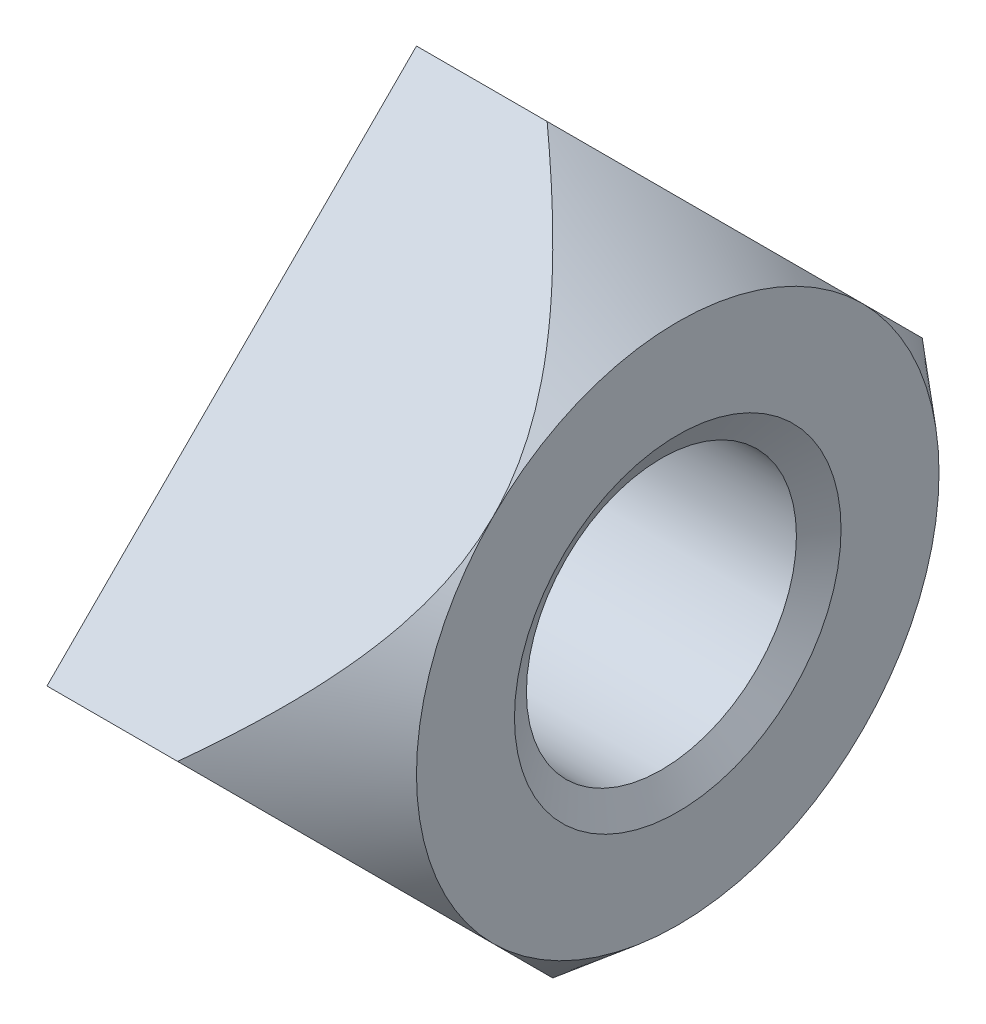
ISO-10303-21;
HEADER;
FILE_DESCRIPTION(('STEP AP214'),'2;1');
FILE_NAME('part.step','',(''),(''),'','','');
FILE_SCHEMA(('AUTOMOTIVE_DESIGN { 1 0 10303 214 1 1 1 1 }'));
ENDSEC;
DATA;
#1=APPLICATION_CONTEXT('core data for automotive mechanical design processes');
#2=APPLICATION_PROTOCOL_DEFINITION('international standard','automotive_design',2000,#1);
#3=PRODUCT_CONTEXT('',#1,'mechanical');
#4=PRODUCT('Part','Part','',(#3));
#5=PRODUCT_RELATED_PRODUCT_CATEGORY('part','',(#4));
#6=PRODUCT_DEFINITION_FORMATION('','',#4);
#7=PRODUCT_DEFINITION_CONTEXT('part definition',#1,'design');
#8=PRODUCT_DEFINITION('design','',#6,#7);
#9=PRODUCT_DEFINITION_SHAPE('','',#8);
#10=(LENGTH_UNIT() NAMED_UNIT(*) SI_UNIT(.MILLI.,.METRE.));
#11=(NAMED_UNIT(*) PLANE_ANGLE_UNIT() SI_UNIT($,.RADIAN.));
#12=(NAMED_UNIT(*) SI_UNIT($,.STERADIAN.) SOLID_ANGLE_UNIT());
#13=UNCERTAINTY_MEASURE_WITH_UNIT(LENGTH_MEASURE(1.E-05),#10,'distance_accuracy_value','');
#14=(GEOMETRIC_REPRESENTATION_CONTEXT(3) GLOBAL_UNCERTAINTY_ASSIGNED_CONTEXT((#13)) GLOBAL_UNIT_ASSIGNED_CONTEXT((#10,
#11,#12)) REPRESENTATION_CONTEXT('',''));
#15=CARTESIAN_POINT('',(0.,0.,0.));
#16=DIRECTION('',(0.,0.,1.));
#17=DIRECTION('',(1.,0.,0.));
#18=AXIS2_PLACEMENT_3D('',#15,#16,#17);
#19=CARTESIAN_POINT('',(0.,5.65685424949238,0.));
#20=DIRECTION('',(0.,0.707106781186548,-0.707106781186548));
#21=DIRECTION('',(0.,0.707106781186548,0.707106781186548));
#22=AXIS2_PLACEMENT_3D('',#19,#20,#21);
#23=PLANE('',#22);
#24=DIRECTION('',(0.,0.707106781186547,0.707106781186548));
#25=VECTOR('',#24,1.);
#26=CARTESIAN_POINT('',(0.,0.,-5.65685424949238));
#27=LINE('',#26,#25);
#28=CARTESIAN_POINT('',(0.,0.,-5.65685424949238));
#29=VERTEX_POINT('',#28);
#30=CARTESIAN_POINT('',(0.,5.65685424949238,0.));
#31=VERTEX_POINT('',#30);
#32=EDGE_CURVE('E97',#29,#31,#27,.T.);
#33=ORIENTED_EDGE('',*,*,#32,.T.);
#34=DIRECTION('',(1.,0.,0.));
#35=VECTOR('',#34,1.);
#36=CARTESIAN_POINT('',(0.,5.65685424949239,0.));
#37=LINE('',#36,#35);
#38=CARTESIAN_POINT('',(2.00000001497179,5.65685423576791,-1.37244708108853E-08));
#39=VERTEX_POINT('',#38);
#40=EDGE_CURVE('E94',#39,#31,#37,.F.);
#41=ORIENTED_EDGE('',*,*,#40,.F.);
#42=CARTESIAN_POINT('',(4.00000000162505,2.82842712469805,-2.82842712469805));
#43=CARTESIAN_POINT('',(4.00000389309699,2.86553736767645,-2.79131688178045));
#44=CARTESIAN_POINT('',(3.99875261047167,2.90264181309776,-2.7542124363849));
#45=CARTESIAN_POINT('',(3.99377703553199,2.97676203370381,-2.68009221579828));
#46=CARTESIAN_POINT('',(3.99005313230525,3.0137778219199,-2.64307642757586));
#47=CARTESIAN_POINT('',(3.97525017886926,3.12442749037937,-2.53242675910625));
#48=CARTESIAN_POINT('',(3.96053954264875,3.1978317227797,-2.45902252671088));
#49=CARTESIAN_POINT('',(3.92247950556887,3.34218649064603,-2.31466775884812));
#50=CARTESIAN_POINT('',(3.89928193162556,3.41315752138932,-2.24369672810354));
#51=CARTESIAN_POINT('',(3.84518223453002,3.5536392761493,-2.1032149733426));
#52=CARTESIAN_POINT('',(3.81427590437951,3.623149180233,-2.03370506925922));
#53=CARTESIAN_POINT('',(3.72495061105056,3.80237685552954,-1.85447739396309));
#54=CARTESIAN_POINT('',(3.66124458545734,3.91077693607113,-1.74607731342131));
#55=CARTESIAN_POINT('',(3.52074647981355,4.12323916000636,-1.53361508948595));
#56=CARTESIAN_POINT('',(3.44394435272208,4.22729789595227,-1.42955635354009));
#57=CARTESIAN_POINT('',(3.27960607328948,4.43266476485872,-1.22418948463367));
#58=CARTESIAN_POINT('',(3.19195419496411,4.53392609244055,-1.12292815705184));
#59=CARTESIAN_POINT('',(3.00918630242558,4.73293866254087,-0.923915586951505));
#60=CARTESIAN_POINT('',(2.91407263205681,4.83069099332918,-0.826163256163193));
#61=CARTESIAN_POINT('',(2.68698627585763,5.05394950334304,-0.60290474614934));
#62=CARTESIAN_POINT('',(2.55291784581515,5.17838589405658,-0.478468355435798));
#63=CARTESIAN_POINT('',(2.34766871826669,5.361061835931,-0.295792413561378));
#64=CARTESIAN_POINT('',(2.27914083218619,5.42081556040464,-0.236038689087738));
#65=CARTESIAN_POINT('',(2.14061770493488,5.53945641538055,-0.117397834111826));
#66=CARTESIAN_POINT('',(2.07062262159426,5.59834363794652,-0.0585106115458622));
#67=CARTESIAN_POINT('',(2.00000003219478,5.65685422149992,-2.79924604427178E-08));
#68=B_SPLINE_CURVE_WITH_KNOTS('',3,(#42,#43,#44,#45,#46,#47,#48,#49,#50,#51,#52,#53,#54,#55,#56,
#57,#58,#59,#60,#61,#62,#63,#64,#65,#66,#67),.UNSPECIFIED.,.F.,.F.,(4,2,2,2,2,2,2,2,2,2,2,2,4),
(0.,0.157414777931186,0.314804791192397,0.628874706757008,0.937580812012083,1.24645576144789,
1.74360479563762,2.24113696186897,2.74452653810761,3.24775862151673,3.91117052554188,
4.23755521156507,4.56390496591843),.UNSPECIFIED.);
#69=CARTESIAN_POINT('',(4.0000000011754,2.82842712502396,-2.82842712502396));
#70=VERTEX_POINT('',#69);
#71=EDGE_CURVE('E168',#70,#39,#68,.T.);
#72=ORIENTED_EDGE('',*,*,#71,.F.);
#73=CARTESIAN_POINT('',(2.00000004059492,3.38564786020558E-08,-5.65685420246291));
#74=CARTESIAN_POINT('',(2.07565016458481,0.0626824784749345,-5.59417176628507));
#75=CARTESIAN_POINT('',(2.15059314112364,0.125798019298903,-5.53105622892502));
#76=CARTESIAN_POINT('',(2.29878559514314,0.253039958257224,-5.40381429250392));
#77=CARTESIAN_POINT('',(2.37203466069001,0.317166596029325,-5.33968765380407));
#78=CARTESIAN_POINT('',(2.51699023191041,0.446963369504896,-5.20989087964427));
#79=CARTESIAN_POINT('',(2.58868371081902,0.512640801541656,-5.14421344785863));
#80=CARTESIAN_POINT('',(2.72963314079584,0.645286994596161,-5.0115672549883));
#81=CARTESIAN_POINT('',(2.79888925763179,0.712255667313801,-4.94459858220373));
#82=CARTESIAN_POINT('',(2.93735336316135,0.850535383900853,-4.80631886556531));
#83=CARTESIAN_POINT('',(3.00643466828788,0.921910119740282,-4.73494412974507));
#84=CARTESIAN_POINT('',(3.14070417214279,1.06646551765415,-4.59038873184525));
#85=CARTESIAN_POINT('',(3.20589278997801,1.139645984111,-4.51720826538326));
#86=CARTESIAN_POINT('',(3.33132997367605,1.28786318782251,-4.36899106166799));
#87=CARTESIAN_POINT('',(3.39159022752654,1.36289494937506,-4.29395930011682));
#88=CARTESIAN_POINT('',(3.50619976496109,1.51516787826736,-4.14168637122551));
#89=CARTESIAN_POINT('',(3.56055116252182,1.59240824287417,-4.06444600661834));
#90=CARTESIAN_POINT('',(3.65774238171355,1.74271904797132,-3.91413520152094));
#91=CARTESIAN_POINT('',(3.70116423929371,1.81559995696322,-3.84125429252913));
#92=CARTESIAN_POINT('',(3.78064905899603,1.9633884832786,-3.69346576621381));
#93=CARTESIAN_POINT('',(3.8167098913909,2.03829668006703,-3.61855756942535));
#94=CARTESIAN_POINT('',(3.87974313630627,2.18909933479543,-3.46775491469694));
#95=CARTESIAN_POINT('',(3.90681369673541,2.26497306566978,-3.39188118382259));
#96=CARTESIAN_POINT('',(3.95115419293496,2.41811099391466,-3.23874325557772));
#97=CARTESIAN_POINT('',(3.96843181111569,2.4953740521471,-3.16148019734528));
#98=CARTESIAN_POINT('',(3.98685420878434,2.61535176505813,-3.04150248443425));
#99=CARTESIAN_POINT('',(3.99176254119429,2.65778966671952,-2.99906458277286));
#100=CARTESIAN_POINT('',(3.99834566434411,2.74295774176928,-2.91389650772309));
#101=CARTESIAN_POINT('',(4.00000766191355,2.78568840821563,-2.87116584127675));
#102=CARTESIAN_POINT('',(4.00000000164959,2.82842712474431,-2.82842712474807));
#103=B_SPLINE_CURVE_WITH_KNOTS('',3,(#73,#74,#75,#76,#77,#78,#79,#80,#81,#82,#83,#84,#85,#86,
#87,#88,#89,#90,#91,#92,#93,#94,#95,#96,#97,#98,#99,#100,#101,#102),.UNSPECIFIED.,.F.,.F.,(4,2,
2,2,2,2,2,2,2,2,2,2,2,2,4),(0.,0.349620599170228,0.699325345274281,1.05128989036734,
1.40323045151287,1.77010143677858,2.13693285133392,2.5028674218376,2.86867064024405,
3.20396363789336,3.5393535070604,3.87095130705531,4.20228861242727,4.38285917959157,
4.56413991570658),.UNSPECIFIED.);
#104=CARTESIAN_POINT('',(2.00000001498846,-1.37205579659539E-08,-5.65685423577182));
#105=VERTEX_POINT('',#104);
#106=EDGE_CURVE('E81',#105,#70,#103,.T.);
#107=ORIENTED_EDGE('',*,*,#106,.F.);
#108=DIRECTION('',(1.,0.,0.));
#109=VECTOR('',#108,1.);
#110=CARTESIAN_POINT('',(0.,0.,-5.65685424949238));
#111=LINE('',#110,#109);
#112=EDGE_CURVE('E72',#29,#105,#111,.T.);
#113=ORIENTED_EDGE('',*,*,#112,.F.);
#114=EDGE_LOOP('',(#33,#41,#72,#107,#113));
#115=FACE_BOUND('',#114,.T.);
#116=ADVANCED_FACE('F15',(#115),#23,.T.);
#117=CARTESIAN_POINT('',(0.,0.,5.65685424949238));
#118=DIRECTION('',(0.,0.707106781186547,0.707106781186548));
#119=DIRECTION('',(0.,-0.707106781186548,0.707106781186547));
#120=AXIS2_PLACEMENT_3D('',#117,#118,#119);
#121=PLANE('',#120);
#122=DIRECTION('',(1.,0.,0.));
#123=VECTOR('',#122,1.);
#124=CARTESIAN_POINT('',(0.,0.,5.65685424949238));
#125=LINE('',#124,#123);
#126=CARTESIAN_POINT('',(2.00000001819448,1.63942346002782E-08,5.65685423309814));
#127=VERTEX_POINT('',#126);
#128=CARTESIAN_POINT('',(0.,0.,5.65685424949238));
#129=VERTEX_POINT('',#128);
#130=EDGE_CURVE('E73',#127,#129,#125,.F.);
#131=ORIENTED_EDGE('',*,*,#130,.F.);
#132=CARTESIAN_POINT('',(4.00000000162504,2.82842712469805,2.82842712469805));
#133=CARTESIAN_POINT('',(4.00000389309698,2.79131688178079,2.86553736767611));
#134=CARTESIAN_POINT('',(3.99875261047169,2.75421243638558,2.90264181309709));
#135=CARTESIAN_POINT('',(3.9937770355321,2.68009221579965,2.97676203370245));
#136=CARTESIAN_POINT('',(3.99005313230543,2.64307642757756,3.01377782191821));
#137=CARTESIAN_POINT('',(3.97525017886971,2.53242675910895,3.12442749037668));
#138=CARTESIAN_POINT('',(3.96053954264946,2.45902252671424,3.19783172277635));
#139=CARTESIAN_POINT('',(3.9224795055699,2.31466775885142,3.34218649064273));
#140=CARTESIAN_POINT('',(3.89928193162649,2.24369672810617,3.4131575213867));
#141=CARTESIAN_POINT('',(3.84518223453059,2.10321497334389,3.55363927614801));
#142=CARTESIAN_POINT('',(3.81427590437982,2.03370506925986,3.62314918023237));
#143=CARTESIAN_POINT('',(3.72495061104942,1.85447739396083,3.80237685553181));
#144=CARTESIAN_POINT('',(3.66124458545473,1.74607731341688,3.91077693607558));
#145=CARTESIAN_POINT('',(3.5207464798075,1.53361508947732,4.123239160015));
#146=CARTESIAN_POINT('',(3.44394435271409,1.42955635352943,4.22729789596293));
#147=CARTESIAN_POINT('',(3.27960607328064,1.22418948462333,4.43266476486907));
#148=CARTESIAN_POINT('',(3.19195419495677,1.12292815704366,4.53392609244873));
#149=CARTESIAN_POINT('',(3.00918630242169,0.923915586947467,4.73293866254491));
#150=CARTESIAN_POINT('',(2.91407263205489,0.826163256161125,4.83069099333126));
#151=CARTESIAN_POINT('',(2.68698627681076,0.602904747086648,5.05394950240574));
#152=CARTESIAN_POINT('',(2.55291784779398,0.47846835727349,5.17838589221889));
#153=CARTESIAN_POINT('',(2.34766872183072,0.295792416696062,5.36106183279632));
#154=CARTESIAN_POINT('',(2.27914083627727,0.236038692638824,5.42081555685356));
#155=CARTESIAN_POINT('',(2.14061771009615,0.117397838485161,5.53945641100722));
#156=CARTESIAN_POINT('',(2.07062262729868,0.058510616325048,5.59834363316733));
#157=CARTESIAN_POINT('',(2.0000000384487,3.31733880936239E-08,5.65685421631899));
#158=B_SPLINE_CURVE_WITH_KNOTS('',3,(#132,#133,#134,#135,#136,#137,#138,#139,#140,#141,#142,
#143,#144,#145,#146,#147,#148,#149,#150,#151,#152,#153,#154,#155,#156,#157),.UNSPECIFIED.,.F.,
.F.,(4,2,2,2,2,2,2,2,2,2,2,2,4),(0.,0.157414777929742,0.314804791189509,0.628874706751271,
0.937580812009219,1.24645576144789,1.7436047956478,2.24113696188942,2.74452653811793,
3.24775862151673,3.91117052064458,4.2375552042998,4.56390495628676),.UNSPECIFIED.);
#159=CARTESIAN_POINT('',(4.0000000011754,2.82842712502396,2.82842712502396));
#160=VERTEX_POINT('',#159);
#161=EDGE_CURVE('E127',#160,#127,#158,.T.);
#162=ORIENTED_EDGE('',*,*,#161,.F.);
#163=CARTESIAN_POINT('',(2.00000004058299,5.65685420245787,3.38645890575871E-08));
#164=CARTESIAN_POINT('',(2.07565016457221,5.59417176627938,0.0626824784817339));
#165=CARTESIAN_POINT('',(2.15059314111072,5.53105622891946,0.125798019304764));
#166=CARTESIAN_POINT('',(2.2987855951299,5.40381429249932,0.253039958261537));
#167=CARTESIAN_POINT('',(2.37203466067678,5.3396876538003,0.317166596033027));
#168=CARTESIAN_POINT('',(2.51699023189712,5.20989087964198,0.446963369507273));
#169=CARTESIAN_POINT('',(2.58868371080568,5.144213447857,0.512640801543317));
#170=CARTESIAN_POINT('',(2.72963314078247,5.01156725498805,0.645286994596402));
#171=CARTESIAN_POINT('',(2.79888925761844,4.94459858220419,0.71225566731334));
#172=CARTESIAN_POINT('',(2.9373533631481,4.80631886556722,0.850535383898957));
#173=CARTESIAN_POINT('',(3.00643466827471,4.73494412974771,0.921910119737654));
#174=CARTESIAN_POINT('',(3.14070417212986,4.59038873184936,1.06646551765005));
#175=CARTESIAN_POINT('',(3.20589278996524,4.51720826538811,1.13964598410615));
#176=CARTESIAN_POINT('',(3.33132997366368,4.36899106167434,1.28786318781617));
#177=CARTESIAN_POINT('',(3.39159022751442,4.29395930012392,1.36289494936796));
#178=CARTESIAN_POINT('',(3.50619976494959,4.14168637123413,1.51516787825876));
#179=CARTESIAN_POINT('',(3.56055116251068,4.06444600662771,1.5924082428648));
#180=CARTESIAN_POINT('',(3.65774238170326,3.91413520153173,1.74271904796054));
#181=CARTESIAN_POINT('',(3.7011642392839,3.84125429254057,1.81559995695179));
#182=CARTESIAN_POINT('',(3.78064905898729,3.69346576622654,1.96338848326588));
#183=CARTESIAN_POINT('',(3.81670989138276,3.61855756943873,2.03829668005367));
#184=CARTESIAN_POINT('',(3.87974313629944,3.46775491471157,2.18909933478081));
#185=CARTESIAN_POINT('',(3.90681369672929,3.39188118383784,2.26497306565454));
#186=CARTESIAN_POINT('',(3.95115419293037,3.23874325559417,2.41811099389822));
#187=CARTESIAN_POINT('',(3.96843181111192,3.16148019736229,2.49537405213009));
#188=CARTESIAN_POINT('',(3.98685420878238,3.04150248444893,2.61535176504346));
#189=CARTESIAN_POINT('',(3.99176254119306,2.99906458278464,2.65778966670774));
#190=CARTESIAN_POINT('',(3.99834566434386,2.91389650772902,2.74295774176337));
#191=CARTESIAN_POINT('',(4.00000766191355,2.87116584127972,2.78568840821267));
#192=CARTESIAN_POINT('',(4.00000000164958,2.82842712474808,2.82842712474431));
#193=B_SPLINE_CURVE_WITH_KNOTS('',3,(#163,#164,#165,#166,#167,#168,#169,#170,#171,#172,#173,
#174,#175,#176,#177,#178,#179,#180,#181,#182,#183,#184,#185,#186,#187,#188,#189,#190,#191,#192),
.UNSPECIFIED.,.F.,.F.,(4,2,2,2,2,2,2,2,2,2,2,2,2,2,4),(0.,0.349620599167865,0.699325345269563,
1.05128989036022,1.40323045150335,1.77010143676664,2.13693285131956,2.50286742182085,
2.86867064022491,3.20396363787222,3.53935350703727,3.87095130703016,4.20228861240011,
4.38285917957684,4.5641399157044),.UNSPECIFIED.);
#194=EDGE_CURVE('E39',#39,#160,#193,.T.);
#195=ORIENTED_EDGE('',*,*,#194,.F.);
#196=ORIENTED_EDGE('',*,*,#40,.T.);
#197=DIRECTION('',(0.,-0.707106781186548,0.707106781186547));
#198=VECTOR('',#197,1.);
#199=CARTESIAN_POINT('',(0.,5.65685424949238,0.));
#200=LINE('',#199,#198);
#201=EDGE_CURVE('E100',#31,#129,#200,.T.);
#202=ORIENTED_EDGE('',*,*,#201,.T.);
#203=EDGE_LOOP('',(#131,#162,#195,#196,#202));
#204=FACE_BOUND('',#203,.T.);
#205=ADVANCED_FACE('F138',(#204),#121,.T.);
#206=CARTESIAN_POINT('',(0.,-5.65685424949238,0.));
#207=DIRECTION('',(0.,-0.707106781186548,0.707106781186547));
#208=DIRECTION('',(0.,-0.707106781186547,-0.707106781186548));
#209=AXIS2_PLACEMENT_3D('',#206,#207,#208);
#210=PLANE('',#209);
#211=DIRECTION('',(1.,0.,0.));
#212=VECTOR('',#211,1.);
#213=CARTESIAN_POINT('',(0.,-5.65685424949238,0.));
#214=LINE('',#213,#212);
#215=CARTESIAN_POINT('',(2.00000001497181,-5.65685423576789,1.37244880754627E-08));
#216=VERTEX_POINT('',#215);
#217=CARTESIAN_POINT('',(0.,-5.65685424949238,0.));
#218=VERTEX_POINT('',#217);
#219=EDGE_CURVE('E59',#216,#218,#214,.F.);
#220=ORIENTED_EDGE('',*,*,#219,.F.);
#221=CARTESIAN_POINT('',(4.00000000162504,-2.82842712469805,2.82842712469805));
#222=CARTESIAN_POINT('',(4.00000389309698,-2.86553736767646,2.79131688178045));
#223=CARTESIAN_POINT('',(3.99875261047167,-2.90264181309777,2.7542124363849));
#224=CARTESIAN_POINT('',(3.99377703553198,-2.97676203370381,2.68009221579829));
#225=CARTESIAN_POINT('',(3.99005313230525,-3.01377782191991,2.64307642757586));
#226=CARTESIAN_POINT('',(3.97525017886926,-3.12442749037938,2.53242675910625));
#227=CARTESIAN_POINT('',(3.96053954264875,-3.1978317227797,2.45902252671088));
#228=CARTESIAN_POINT('',(3.92247950556886,-3.34218649064603,2.31466775884812));
#229=CARTESIAN_POINT('',(3.89928193162556,-3.41315752138932,2.24369672810354));
#230=CARTESIAN_POINT('',(3.84518223453001,-3.5536392761493,2.1032149733426));
#231=CARTESIAN_POINT('',(3.8142759043795,-3.62314918023301,2.03370506925922));
#232=CARTESIAN_POINT('',(3.72495061105055,-3.80237685552955,1.85447739396309));
#233=CARTESIAN_POINT('',(3.66124458545734,-3.91077693607114,1.74607731342131));
#234=CARTESIAN_POINT('',(3.52074647981354,-4.12323916000636,1.53361508948595));
#235=CARTESIAN_POINT('',(3.44394435272207,-4.22729789595228,1.42955635354009));
#236=CARTESIAN_POINT('',(3.27960607328948,-4.43266476485873,1.22418948463367));
#237=CARTESIAN_POINT('',(3.19195419496411,-4.53392609244055,1.12292815705183));
#238=CARTESIAN_POINT('',(3.00918630242557,-4.73293866254087,0.923915586951504));
#239=CARTESIAN_POINT('',(2.9140726320568,-4.83069099332919,0.826163256163192));
#240=CARTESIAN_POINT('',(2.68698627585764,-5.05394950334304,0.602904746149346));
#241=CARTESIAN_POINT('',(2.55291784581516,-5.17838589405657,0.478468355435809));
#242=CARTESIAN_POINT('',(2.3476687182667,-5.36106183593098,0.295792413561397));
#243=CARTESIAN_POINT('',(2.27914083218622,-5.42081556040462,0.23603868908776));
#244=CARTESIAN_POINT('',(2.14061770493491,-5.53945641538053,0.117397834111853));
#245=CARTESIAN_POINT('',(2.07062262159429,-5.59834363794649,0.0585106115458926));
#246=CARTESIAN_POINT('',(2.00000003219481,-5.65685422149989,2.79924934257765E-08));
#247=B_SPLINE_CURVE_WITH_KNOTS('',3,(#221,#222,#223,#224,#225,#226,#227,#228,#229,#230,#231,
#232,#233,#234,#235,#236,#237,#238,#239,#240,#241,#242,#243,#244,#245,#246),.UNSPECIFIED.,.F.,
.F.,(4,2,2,2,2,2,2,2,2,2,2,2,4),(0.,0.157414777931187,0.314804791192397,0.628874706757008,
0.937580812012084,1.24645576144789,1.74360479563762,2.24113696186897,2.74452653810761,
3.24775862151674,3.91117052554185,4.23755521156502,4.56390496591836),.UNSPECIFIED.);
#248=CARTESIAN_POINT('',(4.0000000011754,-2.82842712502396,2.82842712502396));
#249=VERTEX_POINT('',#248);
#250=EDGE_CURVE('E63',#249,#216,#247,.T.);
#251=ORIENTED_EDGE('',*,*,#250,.F.);
#252=CARTESIAN_POINT('',(2.00000003144196,-2.55372012351044E-08,5.6568542015556));
#253=CARTESIAN_POINT('',(2.07565015742389,-0.062682472229833,5.59417176921554));
#254=CARTESIAN_POINT('',(2.15059313492845,-0.125798013994227,5.53105623334125));
#255=CARTESIAN_POINT('',(2.29878558996535,-0.253039953828893,5.40381429782092));
#256=CARTESIAN_POINT('',(2.37203465556383,-0.317166591536578,5.33968765853567));
#257=CARTESIAN_POINT('',(2.51699022711945,-0.446963365146998,5.20989088376178));
#258=CARTESIAN_POINT('',(2.58868370631345,-0.51264079738465,5.14421345195115));
#259=CARTESIAN_POINT('',(2.72963313679467,-0.645286990774541,5.01156725887443));
#260=CARTESIAN_POINT('',(2.79888925384954,-0.712255663626735,4.94459858590841));
#261=CARTESIAN_POINT('',(2.93735335983418,-0.850535380508865,4.80631886893895));
#262=CARTESIAN_POINT('',(3.00643466519755,-0.921910116509753,4.73494413297069));
#263=CARTESIAN_POINT('',(3.14070416951212,-1.06646551474678,4.59038873475755));
#264=CARTESIAN_POINT('',(3.20589278757018,-1.13964598136532,4.51720826813027));
#265=CARTESIAN_POINT('',(3.33132997170457,-1.28786318541231,4.36899106407689));
#266=CARTESIAN_POINT('',(3.39159022576841,-1.36289494713871,4.29395930235283));
#267=CARTESIAN_POINT('',(3.50619976361054,-1.51516787638917,4.14168637310406));
#268=CARTESIAN_POINT('',(3.56055116136544,-1.5924082411803,4.06444600831231));
#269=CARTESIAN_POINT('',(3.65774238079886,-1.74271904648244,3.91413520300975));
#270=CARTESIAN_POINT('',(3.70116423844238,-1.81559995548962,3.84125429400271));
#271=CARTESIAN_POINT('',(3.78064905827333,-1.96338848183594,3.69346576765649));
#272=CARTESIAN_POINT('',(3.81670989073362,-2.03829667863999,3.61855757085241));
#273=CARTESIAN_POINT('',(3.8797431357813,-2.1890993334035,3.46775491608887));
#274=CARTESIAN_POINT('',(3.90681369627719,-2.26497306429735,3.39188118519503));
#275=CARTESIAN_POINT('',(3.95115419260936,-2.41811099258582,3.23874325690657));
#276=CARTESIAN_POINT('',(3.9684318108559,-2.49537405084238,3.16148019865));
#277=CARTESIAN_POINT('',(3.98685420865243,-2.61535176398984,3.04150248550255));
#278=CARTESIAN_POINT('',(3.9917625411115,-2.65778966586294,2.99906458362944));
#279=CARTESIAN_POINT('',(3.99834566432746,-2.74295774133935,2.91389650815304));
#280=CARTESIAN_POINT('',(4.00000766191374,-2.78568840800062,2.87116584149176));
#281=CARTESIAN_POINT('',(4.00000000164958,-2.82842712474431,2.82842712474807));
#282=B_SPLINE_CURVE_WITH_KNOTS('',3,(#252,#253,#254,#255,#256,#257,#258,#259,#260,#261,#262,
#263,#264,#265,#266,#267,#268,#269,#270,#271,#272,#273,#274,#275,#276,#277,#278,#279,#280,#281),
.UNSPECIFIED.,.F.,.F.,(4,2,2,2,2,2,2,2,2,2,2,2,2,2,4),(0.,0.349620600145803,0.699325347193026,
1.05128989319673,1.40323045526734,1.77010144147746,2.13693285697511,2.50286742843413,
2.86867064779937,3.20396364558243,3.53935351487567,3.87095131499979,4.20228862050367,
4.38285918857396,4.56413992560064),.UNSPECIFIED.);
#283=EDGE_CURVE('E101',#127,#249,#282,.T.);
#284=ORIENTED_EDGE('',*,*,#283,.F.);
#285=ORIENTED_EDGE('',*,*,#130,.T.);
#286=DIRECTION('',(0.,-0.707106781186547,-0.707106781186548));
#287=VECTOR('',#286,1.);
#288=CARTESIAN_POINT('',(0.,0.,5.65685424949238));
#289=LINE('',#288,#287);
#290=EDGE_CURVE('E67',#129,#218,#289,.T.);
#291=ORIENTED_EDGE('',*,*,#290,.T.);
#292=EDGE_LOOP('',(#220,#251,#284,#285,#291));
#293=FACE_BOUND('',#292,.T.);
#294=ADVANCED_FACE('F61',(#293),#210,.T.);
#295=CARTESIAN_POINT('',(0.,0.,-5.65685424949238));
#296=DIRECTION('',(0.,-0.707106781186547,-0.707106781186548));
#297=DIRECTION('',(0.,0.707106781186548,-0.707106781186547));
#298=AXIS2_PLACEMENT_3D('',#295,#296,#297);
#299=PLANE('',#298);
#300=DIRECTION('',(0.,0.707106781186548,-0.707106781186547));
#301=VECTOR('',#300,1.);
#302=CARTESIAN_POINT('',(0.,-5.65685424949238,0.));
#303=LINE('',#302,#301);
#304=EDGE_CURVE('E102',#218,#29,#303,.T.);
#305=ORIENTED_EDGE('',*,*,#304,.T.);
#306=ORIENTED_EDGE('',*,*,#112,.T.);
#307=CARTESIAN_POINT('',(4.00000000162504,-2.82842712469805,-2.82842712469805));
#308=CARTESIAN_POINT('',(4.00000389309698,-2.79131688178057,-2.86553736767633));
#309=CARTESIAN_POINT('',(3.99875261047169,-2.75421243638514,-2.90264181309753));
#310=CARTESIAN_POINT('',(3.99377703553209,-2.68009221579876,-2.97676203370333));
#311=CARTESIAN_POINT('',(3.99005313230542,-2.64307642757645,-3.01377782191932));
#312=CARTESIAN_POINT('',(3.97525017886968,-2.53242675910718,-3.12442749037845));
#313=CARTESIAN_POINT('',(3.96053954264941,-2.45902252671202,-3.19783172277856));
#314=CARTESIAN_POINT('',(3.92247950557014,-2.31466775884962,-3.34218649064453));
#315=CARTESIAN_POINT('',(3.8992819316272,-2.2436967281052,-3.41315752138767));
#316=CARTESIAN_POINT('',(3.84518223453248,-2.10321497334452,-3.55363927614738));
#317=CARTESIAN_POINT('',(3.81427590438243,-2.03370506926126,-3.62314918023097));
#318=CARTESIAN_POINT('',(3.72495061105426,-1.85447739396437,-3.80237685552826));
#319=CARTESIAN_POINT('',(3.66124458546127,-1.74607731342174,-3.91077693607071));
#320=CARTESIAN_POINT('',(3.52074647981779,-1.53361508948465,-4.12323916000766));
#321=CARTESIAN_POINT('',(3.44394435272642,-1.42955635353792,-4.22729789595444));
#322=CARTESIAN_POINT('',(3.27960607329394,-1.22418948462978,-4.43266476486262));
#323=CARTESIAN_POINT('',(3.19195419496859,-1.12292815704708,-4.53392609244531));
#324=CARTESIAN_POINT('',(3.00918630243002,-0.923915586945024,-4.73293866254735));
#325=CARTESIAN_POINT('',(2.9140726320612,-0.826163256155852,-4.83069099333653));
#326=CARTESIAN_POINT('',(2.68698627586318,-0.60290474614131,-5.05394950335107));
#327=CARTESIAN_POINT('',(2.55291784582199,-0.478468355427887,-5.17838589406449));
#328=CARTESIAN_POINT('',(2.34766871827548,-0.295792413553577,-5.3610618359388));
#329=CARTESIAN_POINT('',(2.27914083219563,-0.236038689079956,-5.42081556041242));
#330=CARTESIAN_POINT('',(2.1406177049456,-0.117397834104067,-5.53945641538831));
#331=CARTESIAN_POINT('',(2.07062262160564,-0.058510611538108,-5.59834363795427));
#332=CARTESIAN_POINT('',(2.00000003220681,-2.79847045924306E-08,-5.65685422150767));
#333=B_SPLINE_CURVE_WITH_KNOTS('',3,(#307,#308,#309,#310,#311,#312,#313,#314,#315,#316,#317,
#318,#319,#320,#321,#322,#323,#324,#325,#326,#327,#328,#329,#330,#331,#332),.UNSPECIFIED.,.F.,
.F.,(4,2,2,2,2,2,2,2,2,2,2,2,4),(0.,0.15741477793068,0.314804791191386,0.628874706755014,
0.937580812009224,1.24645576144416,1.743604795637,2.24113696187146,2.74452653811319,
3.24775862152541,3.91117052554782,4.23755521156973,4.56390496592182),.UNSPECIFIED.);
#334=CARTESIAN_POINT('',(4.0000000011754,-2.82842712502396,-2.82842712502396));
#335=VERTEX_POINT('',#334);
#336=EDGE_CURVE('E85',#335,#105,#333,.T.);
#337=ORIENTED_EDGE('',*,*,#336,.F.);
#338=CARTESIAN_POINT('',(2.00000004058294,-5.65685420245787,-3.38645369290942E-08));
#339=CARTESIAN_POINT('',(2.07565016457217,-5.5941717662794,-0.0626824784816929));
#340=CARTESIAN_POINT('',(2.15059314111068,-5.53105622891949,-0.125798019304729));
#341=CARTESIAN_POINT('',(2.29878559512987,-5.40381429249935,-0.253039958261508));
#342=CARTESIAN_POINT('',(2.37203466067675,-5.33968765380032,-0.317166596032998));
#343=CARTESIAN_POINT('',(2.5169902318971,-5.209890879642,-0.446963369507244));
#344=CARTESIAN_POINT('',(2.58868371080566,-5.14421344785703,-0.512640801543289));
#345=CARTESIAN_POINT('',(2.72963314078245,-5.01156725498807,-0.645286994596377));
#346=CARTESIAN_POINT('',(2.79888925761842,-4.94459858220421,-0.712255667313316));
#347=CARTESIAN_POINT('',(2.93735336314808,-4.80631886556724,-0.850535383898934));
#348=CARTESIAN_POINT('',(3.00643466827469,-4.73494412974773,-0.921910119737632));
#349=CARTESIAN_POINT('',(3.14070417212985,-4.59038873184938,-1.06646551765003));
#350=CARTESIAN_POINT('',(3.20589278996523,-4.51720826538813,-1.13964598410614));
#351=CARTESIAN_POINT('',(3.33132997366367,-4.36899106167436,-1.28786318781615));
#352=CARTESIAN_POINT('',(3.39159022751441,-4.29395930012393,-1.36289494936795));
#353=CARTESIAN_POINT('',(3.50619976494958,-4.14168637123414,-1.51516787825875));
#354=CARTESIAN_POINT('',(3.56055116251067,-4.06444600662772,-1.59240824286479));
#355=CARTESIAN_POINT('',(3.65774238170326,-3.91413520153174,-1.74271904796053));
#356=CARTESIAN_POINT('',(3.70116423928389,-3.84125429254057,-1.81559995695178));
#357=CARTESIAN_POINT('',(3.78064905898729,-3.69346576622655,-1.96338848326587));
#358=CARTESIAN_POINT('',(3.81670989138276,-3.61855756943873,-2.03829668005366));
#359=CARTESIAN_POINT('',(3.87974313629944,-3.46775491471158,-2.1890993347808));
#360=CARTESIAN_POINT('',(3.90681369672929,-3.39188118383785,-2.26497306565453));
#361=CARTESIAN_POINT('',(3.95115419293037,-3.23874325559417,-2.41811099389821));
#362=CARTESIAN_POINT('',(3.96843181111192,-3.1614801973623,-2.49537405213009));
#363=CARTESIAN_POINT('',(3.98685420878238,-3.04150248444893,-2.61535176504345));
#364=CARTESIAN_POINT('',(3.99176254119306,-2.99906458278465,-2.65778966670774));
#365=CARTESIAN_POINT('',(3.99834566434386,-2.91389650772902,-2.74295774176337));
#366=CARTESIAN_POINT('',(4.00000766191355,-2.87116584127972,-2.78568840821267));
#367=CARTESIAN_POINT('',(4.00000000164958,-2.82842712474807,-2.82842712474431));
#368=B_SPLINE_CURVE_WITH_KNOTS('',3,(#338,#339,#340,#341,#342,#343,#344,#345,#346,#347,#348,
#349,#350,#351,#352,#353,#354,#355,#356,#357,#358,#359,#360,#361,#362,#363,#364,#365,#366,#367),
.UNSPECIFIED.,.F.,.F.,(4,2,2,2,2,2,2,2,2,2,2,2,2,2,4),(0.,0.34962059916787,0.699325345269574,
1.05128989036024,1.40323045150337,1.77010143676667,2.1369328513196,2.5028674218209,
2.86867064022495,3.20396363787227,3.53935350703731,3.87095130703021,4.20228861240016,
4.38285917957689,4.56413991570446),.UNSPECIFIED.);
#369=EDGE_CURVE('E19',#216,#335,#368,.T.);
#370=ORIENTED_EDGE('',*,*,#369,.F.);
#371=ORIENTED_EDGE('',*,*,#219,.T.);
#372=EDGE_LOOP('',(#305,#306,#337,#370,#371));
#373=FACE_BOUND('',#372,.T.);
#374=ADVANCED_FACE('F83',(#373),#299,.T.);
#375=CARTESIAN_POINT('',(1.98800008109856,0.,0.));
#376=DIRECTION('',(-1.,0.,0.));
#377=DIRECTION('',(0.,0.,1.));
#378=AXIS2_PLACEMENT_3D('',#375,#376,#377);
#379=CONICAL_SURFACE('',#378,5.66679530646752,0.691835812846211);
#380=CARTESIAN_POINT('',(4.00000000070122,0.,0.));
#381=DIRECTION('',(-1.,0.,0.));
#382=DIRECTION('',(0.,0.,1.));
#383=AXIS2_PLACEMENT_3D('',#380,#381,#382);
#384=CIRCLE('',#383,4.00000000078565);
#385=EDGE_CURVE('E80',#249,#335,#384,.F.);
#386=ORIENTED_EDGE('',*,*,#385,.F.);
#387=ORIENTED_EDGE('',*,*,#250,.T.);
#388=ORIENTED_EDGE('',*,*,#369,.T.);
#389=EDGE_LOOP('',(#386,#387,#388));
#390=FACE_BOUND('',#389,.T.);
#391=ADVANCED_FACE('F78',(#390),#379,.T.);
#392=CARTESIAN_POINT('',(1.98800008132594,0.,0.));
#393=DIRECTION('',(-1.,0.,0.));
#394=DIRECTION('',(0.,0.,1.));
#395=AXIS2_PLACEMENT_3D('',#392,#393,#394);
#396=CONICAL_SURFACE('',#395,5.66679530629699,0.691835812851467);
#397=CARTESIAN_POINT('',(4.00000000070122,0.,0.));
#398=DIRECTION('',(-1.,0.,0.));
#399=DIRECTION('',(0.,0.,1.));
#400=AXIS2_PLACEMENT_3D('',#397,#398,#399);
#401=CIRCLE('',#400,4.00000000078565);
#402=EDGE_CURVE('E117',#335,#70,#401,.F.);
#403=ORIENTED_EDGE('',*,*,#402,.F.);
#404=ORIENTED_EDGE('',*,*,#336,.T.);
#405=ORIENTED_EDGE('',*,*,#106,.T.);
#406=EDGE_LOOP('',(#403,#404,#405));
#407=FACE_BOUND('',#406,.T.);
#408=ADVANCED_FACE('F153',(#407),#396,.T.);
#409=CARTESIAN_POINT('',(1.98800008109856,0.,0.));
#410=DIRECTION('',(-1.,0.,0.));
#411=DIRECTION('',(0.,0.,1.));
#412=AXIS2_PLACEMENT_3D('',#409,#410,#411);
#413=CONICAL_SURFACE('',#412,5.66679530646752,0.691835812846211);
#414=CARTESIAN_POINT('',(4.00000000070122,0.,0.));
#415=DIRECTION('',(-1.,0.,0.));
#416=DIRECTION('',(0.,0.,1.));
#417=AXIS2_PLACEMENT_3D('',#414,#415,#416);
#418=CIRCLE('',#417,4.00000000078565);
#419=EDGE_CURVE('E115',#70,#160,#418,.F.);
#420=ORIENTED_EDGE('',*,*,#419,.F.);
#421=ORIENTED_EDGE('',*,*,#71,.T.);
#422=ORIENTED_EDGE('',*,*,#194,.T.);
#423=EDGE_LOOP('',(#420,#421,#422));
#424=FACE_BOUND('',#423,.T.);
#425=ADVANCED_FACE('F157',(#424),#413,.T.);
#426=CARTESIAN_POINT('',(1.98800008109856,0.,0.));
#427=DIRECTION('',(-1.,0.,0.));
#428=DIRECTION('',(0.,0.,1.));
#429=AXIS2_PLACEMENT_3D('',#426,#427,#428);
#430=CONICAL_SURFACE('',#429,5.66679530646752,0.691835812846211);
#431=ORIENTED_EDGE('',*,*,#283,.T.);
#432=CARTESIAN_POINT('',(4.00000000070122,0.,0.));
#433=DIRECTION('',(-1.,0.,0.));
#434=DIRECTION('',(0.,0.,1.));
#435=AXIS2_PLACEMENT_3D('',#432,#433,#434);
#436=CIRCLE('',#435,4.00000000078565);
#437=EDGE_CURVE('E113',#160,#249,#436,.F.);
#438=ORIENTED_EDGE('',*,*,#437,.F.);
#439=ORIENTED_EDGE('',*,*,#161,.T.);
#440=EDGE_LOOP('',(#431,#438,#439));
#441=FACE_BOUND('',#440,.T.);
#442=ADVANCED_FACE('F132',(#441),#430,.T.);
#443=CARTESIAN_POINT('',(0.,0.,0.));
#444=DIRECTION('',(1.,0.,0.));
#445=DIRECTION('',(0.,0.,-1.));
#446=AXIS2_PLACEMENT_3D('',#443,#444,#445);
#447=PLANE('',#446);
#448=CARTESIAN_POINT('',(-2.68985946392694E-10,0.,0.));
#449=DIRECTION('',(-1.,0.,0.));
#450=DIRECTION('',(0.,0.,1.));
#451=AXIS2_PLACEMENT_3D('',#448,#449,#450);
#452=CIRCLE('',#451,2.50001270177336);
#453=CARTESIAN_POINT('',(-2.68985946392694E-10,0.,2.50001270177336));
#454=VERTEX_POINT('',#453);
#455=EDGE_CURVE('E110',#454,#454,#452,.F.);
#456=ORIENTED_EDGE('',*,*,#455,.T.);
#457=EDGE_LOOP('',(#456));
#458=FACE_BOUND('',#457,.T.);
#459=ORIENTED_EDGE('',*,*,#290,.F.);
#460=ORIENTED_EDGE('',*,*,#201,.F.);
#461=ORIENTED_EDGE('',*,*,#32,.F.);
#462=ORIENTED_EDGE('',*,*,#304,.F.);
#463=EDGE_LOOP('',(#459,#460,#461,#462));
#464=FACE_BOUND('',#463,.T.);
#465=ADVANCED_FACE('F186',(#458,#464),#447,.F.);
#466=CARTESIAN_POINT('',(4.,0.,0.));
#467=DIRECTION('',(1.,0.,0.));
#468=DIRECTION('',(0.,0.,-1.));
#469=AXIS2_PLACEMENT_3D('',#466,#467,#468);
#470=PLANE('',#469);
#471=CARTESIAN_POINT('',(4.00000000030332,0.,0.));
#472=DIRECTION('',(1.,0.,0.));
#473=DIRECTION('',(0.,0.,-1.));
#474=AXIS2_PLACEMENT_3D('',#471,#472,#473);
#475=CIRCLE('',#474,2.50001270177336);
#476=CARTESIAN_POINT('',(4.00000000030332,0.,-2.50001270177336));
#477=VERTEX_POINT('',#476);
#478=EDGE_CURVE('E107',#477,#477,#475,.F.);
#479=ORIENTED_EDGE('',*,*,#478,.T.);
#480=EDGE_LOOP('',(#479));
#481=FACE_BOUND('',#480,.T.);
#482=ORIENTED_EDGE('',*,*,#419,.T.);
#483=ORIENTED_EDGE('',*,*,#437,.T.);
#484=ORIENTED_EDGE('',*,*,#385,.T.);
#485=ORIENTED_EDGE('',*,*,#402,.T.);
#486=EDGE_LOOP('',(#482,#483,#484,#485));
#487=FACE_BOUND('',#486,.T.);
#488=ADVANCED_FACE('F195',(#481,#487),#470,.T.);
#489=CARTESIAN_POINT('',(-1.70530256582424E-10,0.,0.));
#490=DIRECTION('',(-1.,0.,0.));
#491=DIRECTION('',(0.,0.,1.));
#492=AXIS2_PLACEMENT_3D('',#489,#490,#491);
#493=CONICAL_SURFACE('',#492,2.50001270160283,1.04719755002042);
#494=ORIENTED_EDGE('',*,*,#455,.F.);
#495=EDGE_LOOP('',(#494));
#496=FACE_BOUND('',#495,.T.);
#497=CARTESIAN_POINT('',(0.25,0.,0.));
#498=DIRECTION('',(-1.,0.,0.));
#499=DIRECTION('',(0.,0.,1.));
#500=AXIS2_PLACEMENT_3D('',#497,#498,#499);
#501=CIRCLE('',#500,2.067);
#502=CARTESIAN_POINT('',(0.25,0.,2.067));
#503=VERTEX_POINT('',#502);
#504=EDGE_CURVE('E30',#503,#503,#501,.F.);
#505=ORIENTED_EDGE('',*,*,#504,.T.);
#506=EDGE_LOOP('',(#505));
#507=FACE_BOUND('',#506,.T.);
#508=ADVANCED_FACE('F209',(#496,#507),#493,.F.);
#509=CARTESIAN_POINT('',(4.00000000030332,0.,0.));
#510=DIRECTION('',(1.,0.,0.));
#511=DIRECTION('',(0.,0.,-1.));
#512=AXIS2_PLACEMENT_3D('',#509,#510,#511);
#513=CONICAL_SURFACE('',#512,2.50001270177336,1.04719755002042);
#514=ORIENTED_EDGE('',*,*,#478,.F.);
#515=EDGE_LOOP('',(#514));
#516=FACE_BOUND('',#515,.T.);
#517=CARTESIAN_POINT('',(3.75,0.,0.));
#518=DIRECTION('',(-1.,0.,0.));
#519=DIRECTION('',(0.,0.,1.));
#520=AXIS2_PLACEMENT_3D('',#517,#518,#519);
#521=CIRCLE('',#520,2.067);
#522=CARTESIAN_POINT('',(3.75,0.,2.067));
#523=VERTEX_POINT('',#522);
#524=EDGE_CURVE('E9',#523,#523,#521,.T.);
#525=ORIENTED_EDGE('',*,*,#524,.T.);
#526=EDGE_LOOP('',(#525));
#527=FACE_BOUND('',#526,.T.);
#528=ADVANCED_FACE('F203',(#516,#527),#513,.F.);
#529=CARTESIAN_POINT('',(16.4924225024706,0.,0.));
#530=DIRECTION('',(-1.,0.,0.));
#531=DIRECTION('',(0.,0.,1.));
#532=AXIS2_PLACEMENT_3D('',#529,#530,#531);
#533=CYLINDRICAL_SURFACE('',#532,2.067);
#534=ORIENTED_EDGE('',*,*,#524,.F.);
#535=EDGE_LOOP('',(#534));
#536=FACE_BOUND('',#535,.T.);
#537=ORIENTED_EDGE('',*,*,#504,.F.);
#538=EDGE_LOOP('',(#537));
#539=FACE_BOUND('',#538,.T.);
#540=ADVANCED_FACE('F201',(#536,#539),#533,.F.);
#541=CLOSED_SHELL('',(#116,#205,#294,#374,#391,#408,#425,#442,#465,#488,#508,#528,#540));
#542=MANIFOLD_SOLID_BREP('B1',#541);
#543=ADVANCED_BREP_SHAPE_REPRESENTATION('',(#18,#542),#14);
#544=SHAPE_DEFINITION_REPRESENTATION(#9,#543);
ENDSEC;
END-ISO-10303-21;
